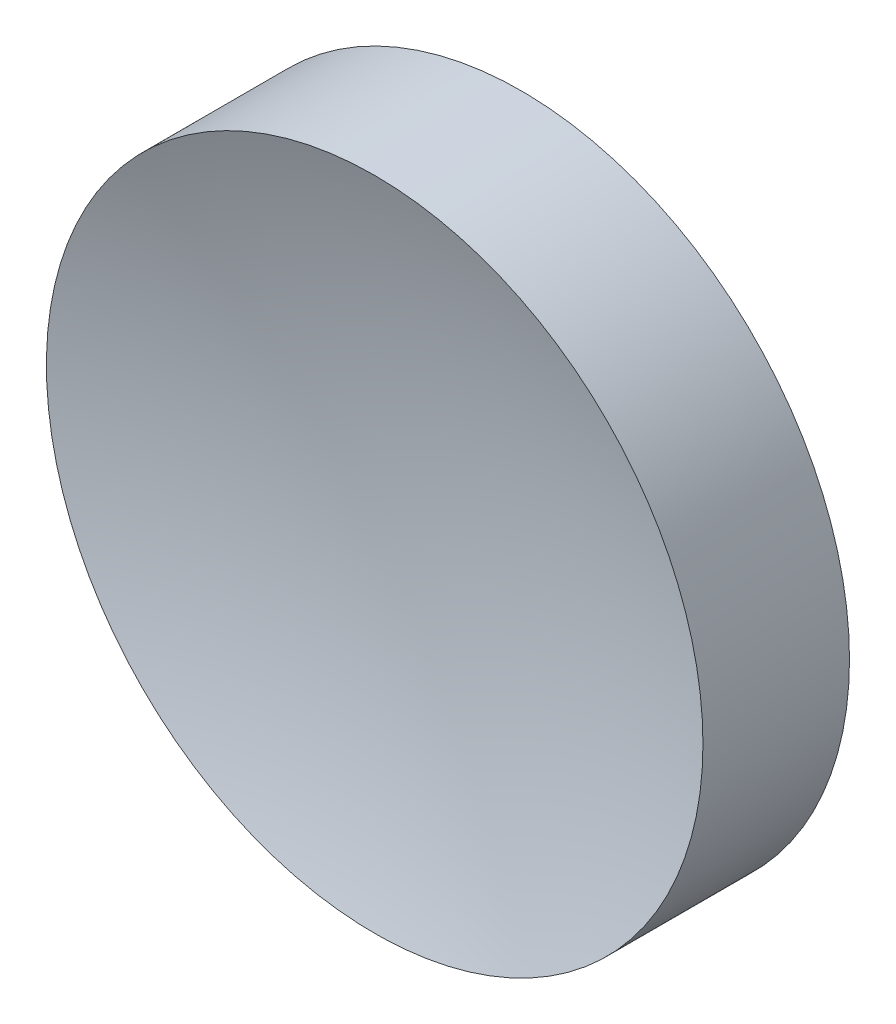
ISO-10303-21;
HEADER;
FILE_DESCRIPTION(('STEP AP214'),'2;1');
FILE_NAME('part.step','',(''),(''),'','','');
FILE_SCHEMA(('AUTOMOTIVE_DESIGN { 1 0 10303 214 1 1 1 1 }'));
ENDSEC;
DATA;
#1=APPLICATION_CONTEXT('core data for automotive mechanical design processes');
#2=APPLICATION_PROTOCOL_DEFINITION('international standard','automotive_design',2000,#1);
#3=PRODUCT_CONTEXT('',#1,'mechanical');
#4=PRODUCT('Part','Part','',(#3));
#5=PRODUCT_RELATED_PRODUCT_CATEGORY('part','',(#4));
#6=PRODUCT_DEFINITION_FORMATION('','',#4);
#7=PRODUCT_DEFINITION_CONTEXT('part definition',#1,'design');
#8=PRODUCT_DEFINITION('design','',#6,#7);
#9=PRODUCT_DEFINITION_SHAPE('','',#8);
#10=(LENGTH_UNIT() NAMED_UNIT(*) SI_UNIT(.MILLI.,.METRE.));
#11=(NAMED_UNIT(*) PLANE_ANGLE_UNIT() SI_UNIT($,.RADIAN.));
#12=(NAMED_UNIT(*) SI_UNIT($,.STERADIAN.) SOLID_ANGLE_UNIT());
#13=UNCERTAINTY_MEASURE_WITH_UNIT(LENGTH_MEASURE(1.E-05),#10,'distance_accuracy_value','');
#14=(GEOMETRIC_REPRESENTATION_CONTEXT(3) GLOBAL_UNCERTAINTY_ASSIGNED_CONTEXT((#13)) GLOBAL_UNIT_ASSIGNED_CONTEXT((#10,
#11,#12)) REPRESENTATION_CONTEXT('',''));
#15=CARTESIAN_POINT('',(0.,0.,0.));
#16=DIRECTION('',(0.,0.,1.));
#17=DIRECTION('',(1.,0.,0.));
#18=AXIS2_PLACEMENT_3D('',#15,#16,#17);
#19=CARTESIAN_POINT('',(0.,0.,39.3099972617742));
#20=DIRECTION('',(0.,0.,1.));
#21=DIRECTION('',(0.,1.,0.));
#22=AXIS2_PLACEMENT_3D('',#19,#20,#21);
#23=SPHERICAL_SURFACE('',#22,38.6);
#24=CARTESIAN_POINT('',(0.,0.,2.79000273822583));
#25=DIRECTION('',(0.,0.,1.));
#26=DIRECTION('',(1.,0.,0.));
#27=AXIS2_PLACEMENT_3D('',#24,#25,#26);
#28=CIRCLE('',#27,12.5);
#29=CARTESIAN_POINT('',(12.5,0.,2.79000273822583));
#30=VERTEX_POINT('',#29);
#31=EDGE_CURVE('E18',#30,#30,#28,.T.);
#32=ORIENTED_EDGE('',*,*,#31,.T.);
#33=EDGE_LOOP('',(#32));
#34=FACE_BOUND('',#33,.T.);
#35=ADVANCED_FACE('F12',(#34),#23,.F.);
#36=CARTESIAN_POINT('',(0.,0.,-2.79000273822583));
#37=DIRECTION('',(0.,0.,1.));
#38=DIRECTION('',(1.,0.,0.));
#39=AXIS2_PLACEMENT_3D('',#36,#37,#38);
#40=PLANE('',#39);
#41=CARTESIAN_POINT('',(0.,0.,-2.79000273822583));
#42=DIRECTION('',(0.,0.,1.));
#43=DIRECTION('',(1.,0.,0.));
#44=AXIS2_PLACEMENT_3D('',#41,#42,#43);
#45=CIRCLE('',#44,12.5);
#46=CARTESIAN_POINT('',(12.5,0.,-2.79000273822583));
#47=VERTEX_POINT('',#46);
#48=EDGE_CURVE('E8',#47,#47,#45,.T.);
#49=ORIENTED_EDGE('',*,*,#48,.F.);
#50=EDGE_LOOP('',(#49));
#51=FACE_BOUND('',#50,.T.);
#52=ADVANCED_FACE('F27',(#51),#40,.F.);
#53=CARTESIAN_POINT('',(0.,0.,7.97715053220349));
#54=DIRECTION('',(0.,0.,1.));
#55=DIRECTION('',(1.,0.,0.));
#56=AXIS2_PLACEMENT_3D('',#53,#54,#55);
#57=CYLINDRICAL_SURFACE('',#56,12.5);
#58=ORIENTED_EDGE('',*,*,#31,.F.);
#59=EDGE_LOOP('',(#58));
#60=FACE_BOUND('',#59,.T.);
#61=ORIENTED_EDGE('',*,*,#48,.T.);
#62=EDGE_LOOP('',(#61));
#63=FACE_BOUND('',#62,.T.);
#64=ADVANCED_FACE('F25',(#60,#63),#57,.T.);
#65=CLOSED_SHELL('',(#35,#52,#64));
#66=MANIFOLD_SOLID_BREP('B1',#65);
#67=ADVANCED_BREP_SHAPE_REPRESENTATION('',(#18,#66),#14);
#68=SHAPE_DEFINITION_REPRESENTATION(#9,#67);
ENDSEC;
END-ISO-10303-21;
